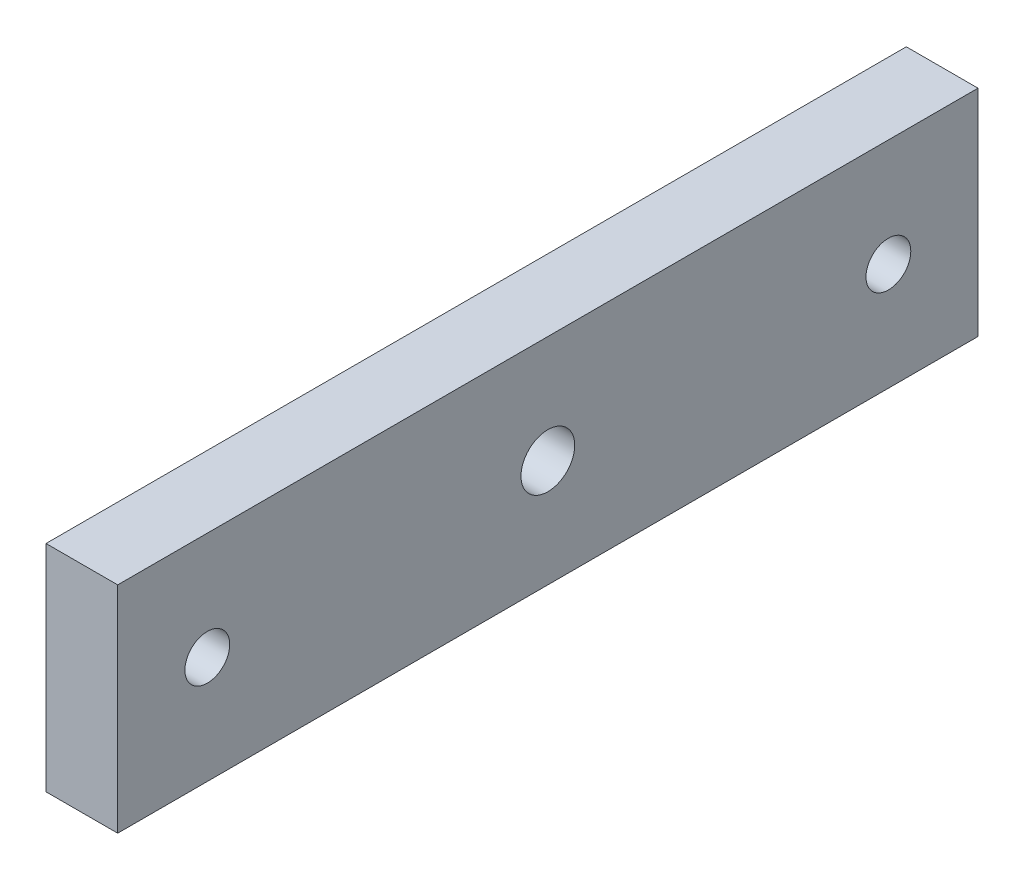
ISO-10303-21;
HEADER;
FILE_DESCRIPTION(('STEP AP214'),'2;1');
FILE_NAME('part.step','',(''),(''),'','','');
FILE_SCHEMA(('AUTOMOTIVE_DESIGN { 1 0 10303 214 1 1 1 1 }'));
ENDSEC;
DATA;
#1=APPLICATION_CONTEXT('core data for automotive mechanical design processes');
#2=APPLICATION_PROTOCOL_DEFINITION('international standard','automotive_design',2000,#1);
#3=PRODUCT_CONTEXT('',#1,'mechanical');
#4=PRODUCT('Part','Part','',(#3));
#5=PRODUCT_RELATED_PRODUCT_CATEGORY('part','',(#4));
#6=PRODUCT_DEFINITION_FORMATION('','',#4);
#7=PRODUCT_DEFINITION_CONTEXT('part definition',#1,'design');
#8=PRODUCT_DEFINITION('design','',#6,#7);
#9=PRODUCT_DEFINITION_SHAPE('','',#8);
#10=(LENGTH_UNIT() NAMED_UNIT(*) SI_UNIT(.MILLI.,.METRE.));
#11=(NAMED_UNIT(*) PLANE_ANGLE_UNIT() SI_UNIT($,.RADIAN.));
#12=(NAMED_UNIT(*) SI_UNIT($,.STERADIAN.) SOLID_ANGLE_UNIT());
#13=UNCERTAINTY_MEASURE_WITH_UNIT(LENGTH_MEASURE(1.E-05),#10,'distance_accuracy_value','');
#14=(GEOMETRIC_REPRESENTATION_CONTEXT(3) GLOBAL_UNCERTAINTY_ASSIGNED_CONTEXT((#13)) GLOBAL_UNIT_ASSIGNED_CONTEXT((#10,
#11,#12)) REPRESENTATION_CONTEXT('',''));
#15=CARTESIAN_POINT('',(0.,0.,0.));
#16=DIRECTION('',(0.,0.,1.));
#17=DIRECTION('',(1.,0.,0.));
#18=AXIS2_PLACEMENT_3D('',#15,#16,#17);
#19=CARTESIAN_POINT('',(6.35,0.,0.));
#20=DIRECTION('',(1.,0.,0.));
#21=DIRECTION('',(0.,0.,-1.));
#22=AXIS2_PLACEMENT_3D('',#19,#20,#21);
#23=CYLINDRICAL_SURFACE('',#22,4.7625);
#24=CARTESIAN_POINT('',(6.35,0.,0.));
#25=DIRECTION('',(1.,0.,0.));
#26=DIRECTION('',(0.,0.,-1.));
#27=AXIS2_PLACEMENT_3D('',#24,#25,#26);
#28=CIRCLE('',#27,4.7625);
#29=CARTESIAN_POINT('',(6.35,0.,-4.7625));
#30=VERTEX_POINT('',#29);
#31=EDGE_CURVE('E127',#30,#30,#28,.T.);
#32=ORIENTED_EDGE('',*,*,#31,.T.);
#33=EDGE_LOOP('',(#32));
#34=FACE_BOUND('',#33,.T.);
#35=CARTESIAN_POINT('',(-3.175,0.,0.));
#36=DIRECTION('',(-1.,0.,0.));
#37=DIRECTION('',(0.,-1.,0.));
#38=AXIS2_PLACEMENT_3D('',#35,#36,#37);
#39=CIRCLE('',#38,4.7625);
#40=CARTESIAN_POINT('',(-3.175,-4.7625,0.));
#41=VERTEX_POINT('',#40);
#42=EDGE_CURVE('E40',#41,#41,#39,.F.);
#43=ORIENTED_EDGE('',*,*,#42,.F.);
#44=EDGE_LOOP('',(#43));
#45=FACE_BOUND('',#44,.T.);
#46=ADVANCED_FACE('F36',(#34,#45),#23,.F.);
#47=CARTESIAN_POINT('',(6.35,19.05,76.2));
#48=DIRECTION('',(-1.,0.,0.));
#49=DIRECTION('',(0.,-1.,0.));
#50=AXIS2_PLACEMENT_3D('',#47,#48,#49);
#51=PLANE('',#50);
#52=ORIENTED_EDGE('',*,*,#31,.F.);
#53=EDGE_LOOP('',(#52));
#54=FACE_BOUND('',#53,.T.);
#55=CARTESIAN_POINT('',(6.35,0.,60.325));
#56=DIRECTION('',(1.,0.,0.));
#57=DIRECTION('',(0.,0.,-1.));
#58=AXIS2_PLACEMENT_3D('',#55,#56,#57);
#59=CIRCLE('',#58,3.96874999999999);
#60=CARTESIAN_POINT('',(6.35,0.,56.35625));
#61=VERTEX_POINT('',#60);
#62=EDGE_CURVE('E124',#61,#61,#59,.T.);
#63=ORIENTED_EDGE('',*,*,#62,.F.);
#64=EDGE_LOOP('',(#63));
#65=FACE_BOUND('',#64,.T.);
#66=CARTESIAN_POINT('',(6.35,0.,-60.325));
#67=DIRECTION('',(1.,0.,0.));
#68=DIRECTION('',(0.,0.,-1.));
#69=AXIS2_PLACEMENT_3D('',#66,#67,#68);
#70=CIRCLE('',#69,3.96874999999999);
#71=CARTESIAN_POINT('',(6.35,0.,-64.29375));
#72=VERTEX_POINT('',#71);
#73=EDGE_CURVE('E118',#72,#72,#70,.T.);
#74=ORIENTED_EDGE('',*,*,#73,.F.);
#75=EDGE_LOOP('',(#74));
#76=FACE_BOUND('',#75,.T.);
#77=DIRECTION('',(0.,1.,0.));
#78=VECTOR('',#77,1.);
#79=CARTESIAN_POINT('',(6.35,19.05,-76.2));
#80=LINE('',#79,#78);
#81=CARTESIAN_POINT('',(6.35,-19.05,-76.2));
#82=VERTEX_POINT('',#81);
#83=CARTESIAN_POINT('',(6.35,19.05,-76.2));
#84=VERTEX_POINT('',#83);
#85=EDGE_CURVE('E102',#82,#84,#80,.T.);
#86=ORIENTED_EDGE('',*,*,#85,.T.);
#87=DIRECTION('',(0.,0.,-1.));
#88=VECTOR('',#87,1.);
#89=CARTESIAN_POINT('',(6.35,19.05,76.2));
#90=LINE('',#89,#88);
#91=CARTESIAN_POINT('',(6.35,19.05,76.2));
#92=VERTEX_POINT('',#91);
#93=EDGE_CURVE('E11',#92,#84,#90,.T.);
#94=ORIENTED_EDGE('',*,*,#93,.F.);
#95=DIRECTION('',(0.,1.,0.));
#96=VECTOR('',#95,1.);
#97=CARTESIAN_POINT('',(6.35,19.05,76.2));
#98=LINE('',#97,#96);
#99=CARTESIAN_POINT('',(6.35,-19.05,76.2));
#100=VERTEX_POINT('',#99);
#101=EDGE_CURVE('E89',#100,#92,#98,.T.);
#102=ORIENTED_EDGE('',*,*,#101,.F.);
#103=DIRECTION('',(0.,0.,-1.));
#104=VECTOR('',#103,1.);
#105=CARTESIAN_POINT('',(6.35,-19.05,76.2));
#106=LINE('',#105,#104);
#107=EDGE_CURVE('E98',#100,#82,#106,.T.);
#108=ORIENTED_EDGE('',*,*,#107,.T.);
#109=EDGE_LOOP('',(#86,#94,#102,#108));
#110=FACE_BOUND('',#109,.T.);
#111=ADVANCED_FACE('F38',(#54,#65,#76,#110),#51,.F.);
#112=CARTESIAN_POINT('',(-6.35,19.05,76.2));
#113=DIRECTION('',(0.,-1.,0.));
#114=DIRECTION('',(0.,0.,-1.));
#115=AXIS2_PLACEMENT_3D('',#112,#113,#114);
#116=PLANE('',#115);
#117=DIRECTION('',(-1.,0.,0.));
#118=VECTOR('',#117,1.);
#119=CARTESIAN_POINT('',(-6.35,19.05,-76.2));
#120=LINE('',#119,#118);
#121=CARTESIAN_POINT('',(-6.35,19.05,-76.2));
#122=VERTEX_POINT('',#121);
#123=EDGE_CURVE('E93',#84,#122,#120,.T.);
#124=ORIENTED_EDGE('',*,*,#123,.T.);
#125=DIRECTION('',(0.,0.,-1.));
#126=VECTOR('',#125,1.);
#127=CARTESIAN_POINT('',(-6.35,19.05,76.2));
#128=LINE('',#127,#126);
#129=CARTESIAN_POINT('',(-6.35,19.05,76.2));
#130=VERTEX_POINT('',#129);
#131=EDGE_CURVE('E46',#130,#122,#128,.T.);
#132=ORIENTED_EDGE('',*,*,#131,.F.);
#133=DIRECTION('',(-1.,0.,0.));
#134=VECTOR('',#133,1.);
#135=CARTESIAN_POINT('',(-6.35,19.05,76.2));
#136=LINE('',#135,#134);
#137=EDGE_CURVE('E84',#92,#130,#136,.T.);
#138=ORIENTED_EDGE('',*,*,#137,.F.);
#139=ORIENTED_EDGE('',*,*,#93,.T.);
#140=EDGE_LOOP('',(#124,#132,#138,#139));
#141=FACE_BOUND('',#140,.T.);
#142=ADVANCED_FACE('F92',(#141),#116,.F.);
#143=CARTESIAN_POINT('',(-6.35,19.05,76.2));
#144=DIRECTION('',(1.,0.,0.));
#145=DIRECTION('',(0.,1.,0.));
#146=AXIS2_PLACEMENT_3D('',#143,#144,#145);
#147=PLANE('',#146);
#148=CARTESIAN_POINT('',(-6.35,0.,0.));
#149=DIRECTION('',(-1.,0.,0.));
#150=DIRECTION('',(0.,-1.,0.));
#151=AXIS2_PLACEMENT_3D('',#148,#149,#150);
#152=CIRCLE('',#151,12.827);
#153=CARTESIAN_POINT('',(-6.34999999999999,-12.827,0.));
#154=VERTEX_POINT('',#153);
#155=EDGE_CURVE('E130',#154,#154,#152,.T.);
#156=ORIENTED_EDGE('',*,*,#155,.F.);
#157=EDGE_LOOP('',(#156));
#158=FACE_BOUND('',#157,.T.);
#159=CARTESIAN_POINT('',(-6.35,0.,60.325));
#160=DIRECTION('',(1.,0.,0.));
#161=DIRECTION('',(0.,1.,0.));
#162=AXIS2_PLACEMENT_3D('',#159,#160,#161);
#163=CIRCLE('',#162,3.96874999999999);
#164=CARTESIAN_POINT('',(-6.35,3.96874999999999,60.325));
#165=VERTEX_POINT('',#164);
#166=EDGE_CURVE('E121',#165,#165,#163,.T.);
#167=ORIENTED_EDGE('',*,*,#166,.T.);
#168=EDGE_LOOP('',(#167));
#169=FACE_BOUND('',#168,.T.);
#170=CARTESIAN_POINT('',(-6.35,0.,-60.325));
#171=DIRECTION('',(1.,0.,0.));
#172=DIRECTION('',(0.,1.,0.));
#173=AXIS2_PLACEMENT_3D('',#170,#171,#172);
#174=CIRCLE('',#173,3.96874999999999);
#175=CARTESIAN_POINT('',(-6.35,3.96875000000002,-60.325));
#176=VERTEX_POINT('',#175);
#177=EDGE_CURVE('E105',#176,#176,#174,.T.);
#178=ORIENTED_EDGE('',*,*,#177,.T.);
#179=EDGE_LOOP('',(#178));
#180=FACE_BOUND('',#179,.T.);
#181=DIRECTION('',(0.,-1.,0.));
#182=VECTOR('',#181,1.);
#183=CARTESIAN_POINT('',(-6.35,19.05,-76.2));
#184=LINE('',#183,#182);
#185=CARTESIAN_POINT('',(-6.34999999999999,-19.05,-76.2));
#186=VERTEX_POINT('',#185);
#187=EDGE_CURVE('E71',#122,#186,#184,.T.);
#188=ORIENTED_EDGE('',*,*,#187,.T.);
#189=DIRECTION('',(0.,0.,-1.));
#190=VECTOR('',#189,1.);
#191=CARTESIAN_POINT('',(-6.34999999999999,-19.05,76.2));
#192=LINE('',#191,#190);
#193=CARTESIAN_POINT('',(-6.34999999999999,-19.05,76.2));
#194=VERTEX_POINT('',#193);
#195=EDGE_CURVE('E94',#194,#186,#192,.T.);
#196=ORIENTED_EDGE('',*,*,#195,.F.);
#197=DIRECTION('',(0.,-1.,0.));
#198=VECTOR('',#197,1.);
#199=CARTESIAN_POINT('',(-6.35,19.05,76.2));
#200=LINE('',#199,#198);
#201=EDGE_CURVE('E87',#130,#194,#200,.T.);
#202=ORIENTED_EDGE('',*,*,#201,.F.);
#203=ORIENTED_EDGE('',*,*,#131,.T.);
#204=EDGE_LOOP('',(#188,#196,#202,#203));
#205=FACE_BOUND('',#204,.T.);
#206=ADVANCED_FACE('F96',(#158,#169,#180,#205),#147,.F.);
#207=CARTESIAN_POINT('',(-6.34999999999999,-19.05,76.2));
#208=DIRECTION('',(0.,1.,0.));
#209=DIRECTION('',(0.,0.,1.));
#210=AXIS2_PLACEMENT_3D('',#207,#208,#209);
#211=PLANE('',#210);
#212=DIRECTION('',(1.,0.,0.));
#213=VECTOR('',#212,1.);
#214=CARTESIAN_POINT('',(-6.34999999999999,-19.05,-76.2));
#215=LINE('',#214,#213);
#216=EDGE_CURVE('E77',#186,#82,#215,.T.);
#217=ORIENTED_EDGE('',*,*,#216,.T.);
#218=ORIENTED_EDGE('',*,*,#107,.F.);
#219=DIRECTION('',(1.,0.,0.));
#220=VECTOR('',#219,1.);
#221=CARTESIAN_POINT('',(-6.34999999999999,-19.05,76.2));
#222=LINE('',#221,#220);
#223=EDGE_CURVE('E54',#194,#100,#222,.T.);
#224=ORIENTED_EDGE('',*,*,#223,.F.);
#225=ORIENTED_EDGE('',*,*,#195,.T.);
#226=EDGE_LOOP('',(#217,#218,#224,#225));
#227=FACE_BOUND('',#226,.T.);
#228=ADVANCED_FACE('F110',(#227),#211,.F.);
#229=CARTESIAN_POINT('',(6.35,-19.05,76.2));
#230=DIRECTION('',(0.,0.,1.));
#231=DIRECTION('',(1.,0.,0.));
#232=AXIS2_PLACEMENT_3D('',#229,#230,#231);
#233=PLANE('',#232);
#234=ORIENTED_EDGE('',*,*,#101,.T.);
#235=ORIENTED_EDGE('',*,*,#137,.T.);
#236=ORIENTED_EDGE('',*,*,#201,.T.);
#237=ORIENTED_EDGE('',*,*,#223,.T.);
#238=EDGE_LOOP('',(#234,#235,#236,#237));
#239=FACE_BOUND('',#238,.T.);
#240=ADVANCED_FACE('F85',(#239),#233,.T.);
#241=CARTESIAN_POINT('',(6.35,-19.05,-76.2));
#242=DIRECTION('',(0.,0.,1.));
#243=DIRECTION('',(1.,0.,0.));
#244=AXIS2_PLACEMENT_3D('',#241,#242,#243);
#245=PLANE('',#244);
#246=ORIENTED_EDGE('',*,*,#85,.F.);
#247=ORIENTED_EDGE('',*,*,#216,.F.);
#248=ORIENTED_EDGE('',*,*,#187,.F.);
#249=ORIENTED_EDGE('',*,*,#123,.F.);
#250=EDGE_LOOP('',(#246,#247,#248,#249));
#251=FACE_BOUND('',#250,.T.);
#252=ADVANCED_FACE('F113',(#251),#245,.F.);
#253=CARTESIAN_POINT('',(6.35,0.,-60.325));
#254=DIRECTION('',(1.,0.,0.));
#255=DIRECTION('',(0.,0.,-1.));
#256=AXIS2_PLACEMENT_3D('',#253,#254,#255);
#257=CYLINDRICAL_SURFACE('',#256,3.96874999999999);
#258=ORIENTED_EDGE('',*,*,#177,.F.);
#259=EDGE_LOOP('',(#258));
#260=FACE_BOUND('',#259,.T.);
#261=ORIENTED_EDGE('',*,*,#73,.T.);
#262=EDGE_LOOP('',(#261));
#263=FACE_BOUND('',#262,.T.);
#264=ADVANCED_FACE('F156',(#260,#263),#257,.F.);
#265=CARTESIAN_POINT('',(6.35,0.,60.325));
#266=DIRECTION('',(1.,0.,0.));
#267=DIRECTION('',(0.,0.,-1.));
#268=AXIS2_PLACEMENT_3D('',#265,#266,#267);
#269=CYLINDRICAL_SURFACE('',#268,3.96874999999999);
#270=ORIENTED_EDGE('',*,*,#166,.F.);
#271=EDGE_LOOP('',(#270));
#272=FACE_BOUND('',#271,.T.);
#273=ORIENTED_EDGE('',*,*,#62,.T.);
#274=EDGE_LOOP('',(#273));
#275=FACE_BOUND('',#274,.T.);
#276=ADVANCED_FACE('F153',(#272,#275),#269,.F.);
#277=CARTESIAN_POINT('',(-3.175,0.,0.));
#278=DIRECTION('',(-1.,0.,0.));
#279=DIRECTION('',(0.,-1.,0.));
#280=AXIS2_PLACEMENT_3D('',#277,#278,#279);
#281=PLANE('',#280);
#282=CARTESIAN_POINT('',(-3.175,0.,0.));
#283=DIRECTION('',(-1.,0.,0.));
#284=DIRECTION('',(0.,-1.,0.));
#285=AXIS2_PLACEMENT_3D('',#282,#283,#284);
#286=CIRCLE('',#285,12.827);
#287=CARTESIAN_POINT('',(-3.17499999999999,-12.827,0.));
#288=VERTEX_POINT('',#287);
#289=EDGE_CURVE('E133',#288,#288,#286,.T.);
#290=ORIENTED_EDGE('',*,*,#289,.T.);
#291=EDGE_LOOP('',(#290));
#292=FACE_BOUND('',#291,.T.);
#293=ORIENTED_EDGE('',*,*,#42,.T.);
#294=EDGE_LOOP('',(#293));
#295=FACE_BOUND('',#294,.T.);
#296=ADVANCED_FACE('F140',(#292,#295),#281,.T.);
#297=CARTESIAN_POINT('',(-3.175,0.,0.));
#298=DIRECTION('',(-1.,0.,0.));
#299=DIRECTION('',(0.,-1.,0.));
#300=AXIS2_PLACEMENT_3D('',#297,#298,#299);
#301=CYLINDRICAL_SURFACE('',#300,12.827);
#302=ORIENTED_EDGE('',*,*,#289,.F.);
#303=EDGE_LOOP('',(#302));
#304=FACE_BOUND('',#303,.T.);
#305=ORIENTED_EDGE('',*,*,#155,.T.);
#306=EDGE_LOOP('',(#305));
#307=FACE_BOUND('',#306,.T.);
#308=ADVANCED_FACE('F151',(#304,#307),#301,.F.);
#309=CLOSED_SHELL('',(#46,#111,#142,#206,#228,#240,#252,#264,#276,#296,#308));
#310=MANIFOLD_SOLID_BREP('B2',#309);
#311=ADVANCED_BREP_SHAPE_REPRESENTATION('',(#18,#310),#14);
#312=SHAPE_DEFINITION_REPRESENTATION(#9,#311);
ENDSEC;
END-ISO-10303-21;
